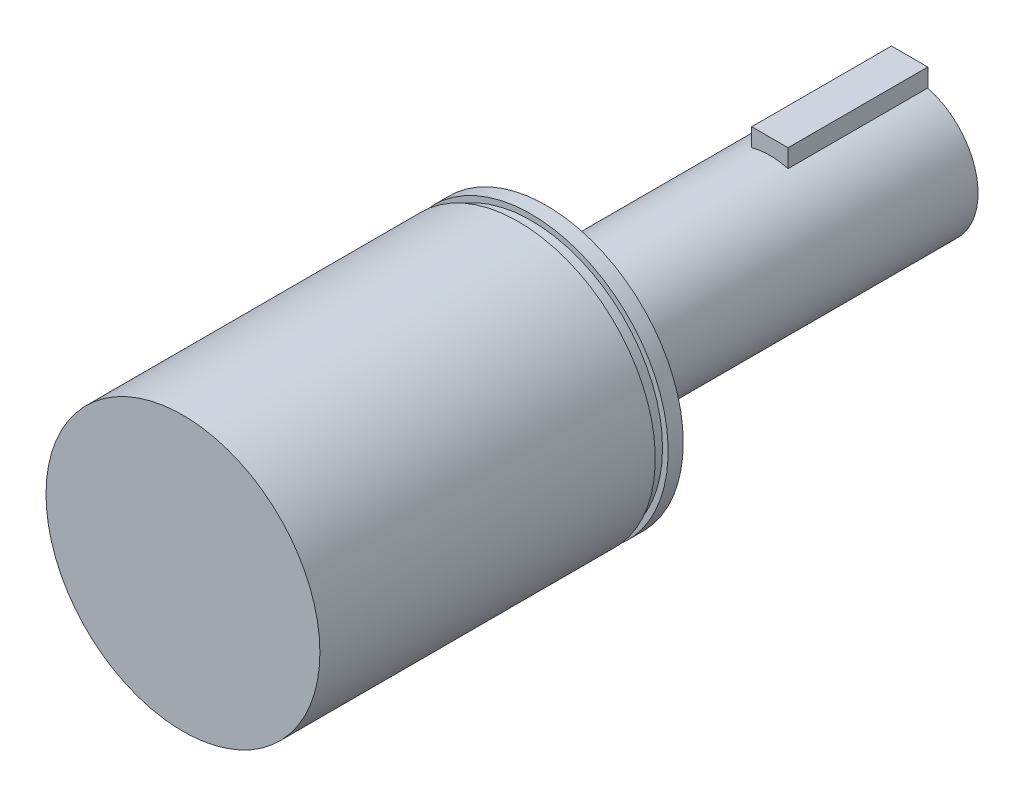
ISO-10303-21;
HEADER;
FILE_DESCRIPTION(('STEP AP214'),'2;1');
FILE_NAME('part.step','',(''),(''),'','','');
FILE_SCHEMA(('AUTOMOTIVE_DESIGN { 1 0 10303 214 1 1 1 1 }'));
ENDSEC;
DATA;
#1=APPLICATION_CONTEXT('core data for automotive mechanical design processes');
#2=APPLICATION_PROTOCOL_DEFINITION('international standard','automotive_design',2000,#1);
#3=PRODUCT_CONTEXT('',#1,'mechanical');
#4=PRODUCT('Part','Part','',(#3));
#5=PRODUCT_RELATED_PRODUCT_CATEGORY('part','',(#4));
#6=PRODUCT_DEFINITION_FORMATION('','',#4);
#7=PRODUCT_DEFINITION_CONTEXT('part definition',#1,'design');
#8=PRODUCT_DEFINITION('design','',#6,#7);
#9=PRODUCT_DEFINITION_SHAPE('','',#8);
#10=(LENGTH_UNIT() NAMED_UNIT(*) SI_UNIT(.MILLI.,.METRE.));
#11=(NAMED_UNIT(*) PLANE_ANGLE_UNIT() SI_UNIT($,.RADIAN.));
#12=(NAMED_UNIT(*) SI_UNIT($,.STERADIAN.) SOLID_ANGLE_UNIT());
#13=UNCERTAINTY_MEASURE_WITH_UNIT(LENGTH_MEASURE(1.E-05),#10,'distance_accuracy_value','');
#14=(GEOMETRIC_REPRESENTATION_CONTEXT(3) GLOBAL_UNCERTAINTY_ASSIGNED_CONTEXT((#13)) GLOBAL_UNIT_ASSIGNED_CONTEXT((#10,
#11,#12)) REPRESENTATION_CONTEXT('',''));
#15=CARTESIAN_POINT('',(0.,0.,0.));
#16=DIRECTION('',(0.,0.,1.));
#17=DIRECTION('',(1.,0.,0.));
#18=AXIS2_PLACEMENT_3D('',#15,#16,#17);
#19=CARTESIAN_POINT('',(0.,0.,33.02));
#20=DIRECTION('',(0.,0.,-1.));
#21=DIRECTION('',(-1.,0.,0.));
#22=AXIS2_PLACEMENT_3D('',#19,#20,#21);
#23=CYLINDRICAL_SURFACE('',#22,6.223);
#24=CARTESIAN_POINT('',(0.,0.,0.));
#25=DIRECTION('',(0.,0.,1.));
#26=DIRECTION('',(1.,0.,0.));
#27=AXIS2_PLACEMENT_3D('',#24,#25,#26);
#28=CIRCLE('',#27,6.223);
#29=CARTESIAN_POINT('',(-1.651,5.999993999997,0.));
#30=VERTEX_POINT('',#29);
#31=CARTESIAN_POINT('',(1.651,5.999993999997,0.));
#32=VERTEX_POINT('',#31);
#33=EDGE_CURVE('E109',#30,#32,#28,.T.);
#34=ORIENTED_EDGE('',*,*,#33,.T.);
#35=DIRECTION('',(0.,0.,-1.));
#36=VECTOR('',#35,1.);
#37=CARTESIAN_POINT('',(1.651,5.999993999997,33.02));
#38=LINE('',#37,#36);
#39=CARTESIAN_POINT('',(1.651,5.999993999997,12.7));
#40=VERTEX_POINT('',#39);
#41=EDGE_CURVE('E48',#32,#40,#38,.F.);
#42=ORIENTED_EDGE('',*,*,#41,.T.);
#43=CARTESIAN_POINT('',(0.,0.,12.7));
#44=DIRECTION('',(0.,0.,-1.));
#45=DIRECTION('',(-1.,0.,0.));
#46=AXIS2_PLACEMENT_3D('',#43,#44,#45);
#47=CIRCLE('',#46,6.223);
#48=CARTESIAN_POINT('',(-1.651,5.999993999997,12.7));
#49=VERTEX_POINT('',#48);
#50=EDGE_CURVE('E11',#49,#40,#47,.T.);
#51=ORIENTED_EDGE('',*,*,#50,.F.);
#52=DIRECTION('',(0.,0.,-1.));
#53=VECTOR('',#52,1.);
#54=CARTESIAN_POINT('',(-1.651,5.999993999997,33.02));
#55=LINE('',#54,#53);
#56=EDGE_CURVE('E77',#49,#30,#55,.T.);
#57=ORIENTED_EDGE('',*,*,#56,.T.);
#58=EDGE_LOOP('',(#34,#42,#51,#57));
#59=FACE_BOUND('',#58,.T.);
#60=CARTESIAN_POINT('',(0.,0.,33.02));
#61=DIRECTION('',(0.,0.,1.));
#62=DIRECTION('',(1.,0.,0.));
#63=AXIS2_PLACEMENT_3D('',#60,#61,#62);
#64=CIRCLE('',#63,6.223);
#65=CARTESIAN_POINT('',(6.223,0.,33.02));
#66=VERTEX_POINT('',#65);
#67=EDGE_CURVE('E40',#66,#66,#64,.T.);
#68=ORIENTED_EDGE('',*,*,#67,.F.);
#69=EDGE_LOOP('',(#68));
#70=FACE_BOUND('',#69,.T.);
#71=ADVANCED_FACE('F32',(#59,#70),#23,.T.);
#72=CARTESIAN_POINT('',(0.,0.,0.));
#73=DIRECTION('',(0.,0.,1.));
#74=DIRECTION('',(1.,0.,0.));
#75=AXIS2_PLACEMENT_3D('',#72,#73,#74);
#76=PLANE('',#75);
#77=ORIENTED_EDGE('',*,*,#33,.F.);
#78=DIRECTION('',(0.,1.,0.));
#79=VECTOR('',#78,1.);
#80=CARTESIAN_POINT('',(-1.651,7.650993999997,0.));
#81=LINE('',#80,#79);
#82=CARTESIAN_POINT('',(-1.651,7.650993999997,0.));
#83=VERTEX_POINT('',#82);
#84=EDGE_CURVE('E99',#30,#83,#81,.T.);
#85=ORIENTED_EDGE('',*,*,#84,.T.);
#86=DIRECTION('',(1.,0.,0.));
#87=VECTOR('',#86,1.);
#88=CARTESIAN_POINT('',(1.651,7.650993999997,0.));
#89=LINE('',#88,#87);
#90=CARTESIAN_POINT('',(1.651,7.650993999997,0.));
#91=VERTEX_POINT('',#90);
#92=EDGE_CURVE('E87',#83,#91,#89,.T.);
#93=ORIENTED_EDGE('',*,*,#92,.T.);
#94=DIRECTION('',(0.,-1.,0.));
#95=VECTOR('',#94,1.);
#96=CARTESIAN_POINT('',(1.651,7.650993999997,0.));
#97=LINE('',#96,#95);
#98=EDGE_CURVE('E96',#91,#32,#97,.T.);
#99=ORIENTED_EDGE('',*,*,#98,.T.);
#100=EDGE_LOOP('',(#77,#85,#93,#99));
#101=FACE_BOUND('',#100,.T.);
#102=ADVANCED_FACE('F131',(#101),#76,.F.);
#103=CARTESIAN_POINT('',(0.,0.,66.04));
#104=DIRECTION('',(0.,0.,-1.));
#105=DIRECTION('',(-1.,0.,0.));
#106=AXIS2_PLACEMENT_3D('',#103,#104,#105);
#107=CYLINDRICAL_SURFACE('',#106,12.446);
#108=CARTESIAN_POINT('',(0.,0.,34.3916));
#109=DIRECTION('',(0.,0.,-1.));
#110=DIRECTION('',(-1.,0.,0.));
#111=AXIS2_PLACEMENT_3D('',#108,#109,#110);
#112=CIRCLE('',#111,12.446);
#113=CARTESIAN_POINT('',(-12.446,0.,34.3916));
#114=VERTEX_POINT('',#113);
#115=EDGE_CURVE('E35',#114,#114,#112,.T.);
#116=ORIENTED_EDGE('',*,*,#115,.T.);
#117=EDGE_LOOP('',(#116));
#118=FACE_BOUND('',#117,.T.);
#119=CARTESIAN_POINT('',(0.,0.,33.02));
#120=DIRECTION('',(0.,0.,1.));
#121=DIRECTION('',(1.,0.,0.));
#122=AXIS2_PLACEMENT_3D('',#119,#120,#121);
#123=CIRCLE('',#122,12.446);
#124=CARTESIAN_POINT('',(12.446,0.,33.02));
#125=VERTEX_POINT('',#124);
#126=EDGE_CURVE('E105',#125,#125,#123,.T.);
#127=ORIENTED_EDGE('',*,*,#126,.T.);
#128=EDGE_LOOP('',(#127));
#129=FACE_BOUND('',#128,.T.);
#130=ADVANCED_FACE('F139',(#118,#129),#107,.T.);
#131=CARTESIAN_POINT('',(0.,0.,33.02));
#132=DIRECTION('',(0.,0.,1.));
#133=DIRECTION('',(1.,0.,0.));
#134=AXIS2_PLACEMENT_3D('',#131,#132,#133);
#135=PLANE('',#134);
#136=ORIENTED_EDGE('',*,*,#67,.T.);
#137=EDGE_LOOP('',(#136));
#138=FACE_BOUND('',#137,.T.);
#139=ORIENTED_EDGE('',*,*,#126,.F.);
#140=EDGE_LOOP('',(#139));
#141=FACE_BOUND('',#140,.T.);
#142=ADVANCED_FACE('F136',(#138,#141),#135,.F.);
#143=CARTESIAN_POINT('',(1.651,7.650993999997,12.7));
#144=DIRECTION('',(1.,0.,0.));
#145=DIRECTION('',(0.,0.,-1.));
#146=AXIS2_PLACEMENT_3D('',#143,#144,#145);
#147=PLANE('',#146);
#148=ORIENTED_EDGE('',*,*,#41,.F.);
#149=ORIENTED_EDGE('',*,*,#98,.F.);
#150=DIRECTION('',(0.,0.,-1.));
#151=VECTOR('',#150,1.);
#152=CARTESIAN_POINT('',(1.651,7.650993999997,12.7));
#153=LINE('',#152,#151);
#154=CARTESIAN_POINT('',(1.651,7.650993999997,12.7));
#155=VERTEX_POINT('',#154);
#156=EDGE_CURVE('E88',#155,#91,#153,.T.);
#157=ORIENTED_EDGE('',*,*,#156,.F.);
#158=DIRECTION('',(0.,-1.,0.));
#159=VECTOR('',#158,1.);
#160=CARTESIAN_POINT('',(1.651,7.650993999997,12.7));
#161=LINE('',#160,#159);
#162=EDGE_CURVE('E81',#155,#40,#161,.T.);
#163=ORIENTED_EDGE('',*,*,#162,.T.);
#164=EDGE_LOOP('',(#148,#149,#157,#163));
#165=FACE_BOUND('',#164,.T.);
#166=ADVANCED_FACE('F128',(#165),#147,.T.);
#167=CARTESIAN_POINT('',(-1.651,7.650993999997,12.7));
#168=DIRECTION('',(-1.,0.,0.));
#169=DIRECTION('',(0.,-1.,0.));
#170=AXIS2_PLACEMENT_3D('',#167,#168,#169);
#171=PLANE('',#170);
#172=ORIENTED_EDGE('',*,*,#56,.F.);
#173=DIRECTION('',(0.,1.,0.));
#174=VECTOR('',#173,1.);
#175=CARTESIAN_POINT('',(-1.651,7.650993999997,12.7));
#176=LINE('',#175,#174);
#177=CARTESIAN_POINT('',(-1.651,7.650993999997,12.7));
#178=VERTEX_POINT('',#177);
#179=EDGE_CURVE('E71',#49,#178,#176,.T.);
#180=ORIENTED_EDGE('',*,*,#179,.T.);
#181=DIRECTION('',(0.,0.,-1.));
#182=VECTOR('',#181,1.);
#183=CARTESIAN_POINT('',(-1.651,7.650993999997,12.7));
#184=LINE('',#183,#182);
#185=EDGE_CURVE('E75',#178,#83,#184,.T.);
#186=ORIENTED_EDGE('',*,*,#185,.T.);
#187=ORIENTED_EDGE('',*,*,#84,.F.);
#188=EDGE_LOOP('',(#172,#180,#186,#187));
#189=FACE_BOUND('',#188,.T.);
#190=ADVANCED_FACE('F73',(#189),#171,.T.);
#191=CARTESIAN_POINT('',(1.651,7.650993999997,12.7));
#192=DIRECTION('',(0.,1.,0.));
#193=DIRECTION('',(0.,0.,1.));
#194=AXIS2_PLACEMENT_3D('',#191,#192,#193);
#195=PLANE('',#194);
#196=ORIENTED_EDGE('',*,*,#92,.F.);
#197=ORIENTED_EDGE('',*,*,#185,.F.);
#198=DIRECTION('',(1.,0.,0.));
#199=VECTOR('',#198,1.);
#200=CARTESIAN_POINT('',(1.651,7.650993999997,12.7));
#201=LINE('',#200,#199);
#202=EDGE_CURVE('E80',#178,#155,#201,.T.);
#203=ORIENTED_EDGE('',*,*,#202,.T.);
#204=ORIENTED_EDGE('',*,*,#156,.T.);
#205=EDGE_LOOP('',(#196,#197,#203,#204));
#206=FACE_BOUND('',#205,.T.);
#207=ADVANCED_FACE('F85',(#206),#195,.T.);
#208=CARTESIAN_POINT('',(0.,0.,12.7));
#209=DIRECTION('',(0.,0.,-1.));
#210=DIRECTION('',(-1.,0.,0.));
#211=AXIS2_PLACEMENT_3D('',#208,#209,#210);
#212=PLANE('',#211);
#213=ORIENTED_EDGE('',*,*,#179,.F.);
#214=ORIENTED_EDGE('',*,*,#50,.T.);
#215=ORIENTED_EDGE('',*,*,#162,.F.);
#216=ORIENTED_EDGE('',*,*,#202,.F.);
#217=EDGE_LOOP('',(#213,#214,#215,#216));
#218=FACE_BOUND('',#217,.T.);
#219=ADVANCED_FACE('F91',(#218),#212,.F.);
#220=CARTESIAN_POINT('',(0.,0.,34.3916));
#221=DIRECTION('',(0.,0.,-1.));
#222=DIRECTION('',(-1.,0.,0.));
#223=AXIS2_PLACEMENT_3D('',#220,#221,#222);
#224=PLANE('',#223);
#225=CARTESIAN_POINT('',(0.,0.,34.3916));
#226=DIRECTION('',(0.,0.,1.));
#227=DIRECTION('',(1.,0.,0.));
#228=AXIS2_PLACEMENT_3D('',#225,#226,#227);
#229=CIRCLE('',#228,11.938);
#230=CARTESIAN_POINT('',(11.938,0.,34.3916));
#231=VERTEX_POINT('',#230);
#232=EDGE_CURVE('E116',#231,#231,#229,.T.);
#233=ORIENTED_EDGE('',*,*,#232,.F.);
#234=EDGE_LOOP('',(#233));
#235=FACE_BOUND('',#234,.T.);
#236=ORIENTED_EDGE('',*,*,#115,.F.);
#237=EDGE_LOOP('',(#236));
#238=FACE_BOUND('',#237,.T.);
#239=ADVANCED_FACE('F178',(#235,#238),#224,.F.);
#240=CARTESIAN_POINT('',(0.,0.,35.56));
#241=DIRECTION('',(0.,0.,-1.));
#242=DIRECTION('',(-1.,0.,0.));
#243=AXIS2_PLACEMENT_3D('',#240,#241,#242);
#244=PLANE('',#243);
#245=CARTESIAN_POINT('',(0.,0.,35.56));
#246=DIRECTION('',(0.,0.,1.));
#247=DIRECTION('',(1.,0.,0.));
#248=AXIS2_PLACEMENT_3D('',#245,#246,#247);
#249=CIRCLE('',#248,11.938);
#250=CARTESIAN_POINT('',(11.938,0.,35.56));
#251=VERTEX_POINT('',#250);
#252=EDGE_CURVE('E121',#251,#251,#249,.T.);
#253=ORIENTED_EDGE('',*,*,#252,.T.);
#254=EDGE_LOOP('',(#253));
#255=FACE_BOUND('',#254,.T.);
#256=CARTESIAN_POINT('',(0.,0.,35.56));
#257=DIRECTION('',(0.,0.,-1.));
#258=DIRECTION('',(-1.,0.,0.));
#259=AXIS2_PLACEMENT_3D('',#256,#257,#258);
#260=CIRCLE('',#259,12.446);
#261=CARTESIAN_POINT('',(-12.446,0.,35.56));
#262=VERTEX_POINT('',#261);
#263=EDGE_CURVE('E114',#262,#262,#260,.T.);
#264=ORIENTED_EDGE('',*,*,#263,.T.);
#265=EDGE_LOOP('',(#264));
#266=FACE_BOUND('',#265,.T.);
#267=ADVANCED_FACE('F167',(#255,#266),#244,.T.);
#268=CARTESIAN_POINT('',(0.,0.,34.3916));
#269=DIRECTION('',(0.,0.,1.));
#270=DIRECTION('',(1.,0.,0.));
#271=AXIS2_PLACEMENT_3D('',#268,#269,#270);
#272=CYLINDRICAL_SURFACE('',#271,11.938);
#273=ORIENTED_EDGE('',*,*,#232,.T.);
#274=EDGE_LOOP('',(#273));
#275=FACE_BOUND('',#274,.T.);
#276=ORIENTED_EDGE('',*,*,#252,.F.);
#277=EDGE_LOOP('',(#276));
#278=FACE_BOUND('',#277,.T.);
#279=ADVANCED_FACE('F159',(#275,#278),#272,.T.);
#280=CARTESIAN_POINT('',(0.,0.,66.04));
#281=DIRECTION('',(0.,0.,1.));
#282=DIRECTION('',(1.,0.,0.));
#283=AXIS2_PLACEMENT_3D('',#280,#281,#282);
#284=PLANE('',#283);
#285=CARTESIAN_POINT('',(0.,0.,66.04));
#286=DIRECTION('',(0.,0.,1.));
#287=DIRECTION('',(1.,0.,0.));
#288=AXIS2_PLACEMENT_3D('',#285,#286,#287);
#289=CIRCLE('',#288,12.446);
#290=CARTESIAN_POINT('',(12.446,0.,66.04));
#291=VERTEX_POINT('',#290);
#292=EDGE_CURVE('E106',#291,#291,#289,.T.);
#293=ORIENTED_EDGE('',*,*,#292,.T.);
#294=EDGE_LOOP('',(#293));
#295=FACE_BOUND('',#294,.T.);
#296=ADVANCED_FACE('F153',(#295),#284,.T.);
#297=ORIENTED_EDGE('',*,*,#292,.F.);
#298=EDGE_LOOP('',(#297));
#299=FACE_BOUND('',#298,.T.);
#300=ORIENTED_EDGE('',*,*,#263,.F.);
#301=EDGE_LOOP('',(#300));
#302=FACE_BOUND('',#301,.T.);
#303=ADVANCED_FACE('F146',(#299,#302),#107,.T.);
#304=CLOSED_SHELL('',(#71,#102,#130,#142,#166,#190,#207,#219,#239,#267,#279,#296,#303));
#305=MANIFOLD_SOLID_BREP('B2',#304);
#306=ADVANCED_BREP_SHAPE_REPRESENTATION('',(#18,#305),#14);
#307=SHAPE_DEFINITION_REPRESENTATION(#9,#306);
ENDSEC;
END-ISO-10303-21;
